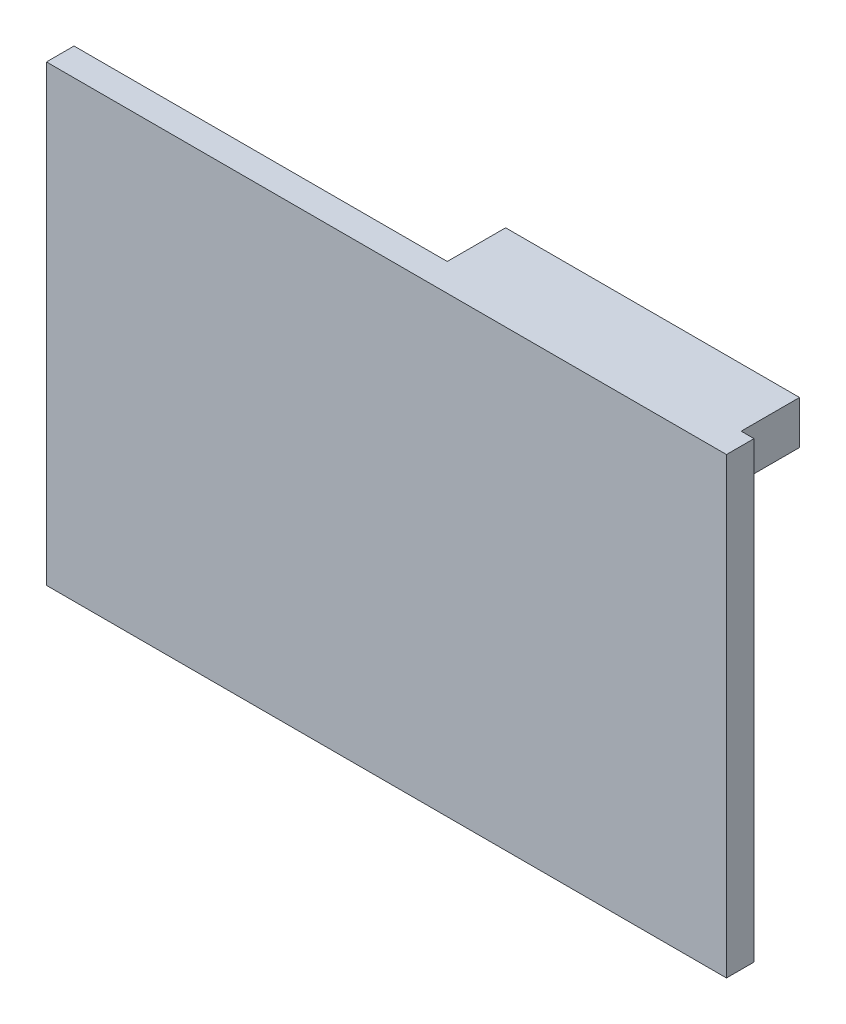
ISO-10303-21;
HEADER;
FILE_DESCRIPTION(('STEP AP214'),'2;1');
FILE_NAME('part.step','',(''),(''),'','','');
FILE_SCHEMA(('AUTOMOTIVE_DESIGN { 1 0 10303 214 1 1 1 1 }'));
ENDSEC;
DATA;
#1=APPLICATION_CONTEXT('core data for automotive mechanical design processes');
#2=APPLICATION_PROTOCOL_DEFINITION('international standard','automotive_design',2000,#1);
#3=PRODUCT_CONTEXT('',#1,'mechanical');
#4=PRODUCT('Part','Part','',(#3));
#5=PRODUCT_RELATED_PRODUCT_CATEGORY('part','',(#4));
#6=PRODUCT_DEFINITION_FORMATION('','',#4);
#7=PRODUCT_DEFINITION_CONTEXT('part definition',#1,'design');
#8=PRODUCT_DEFINITION('design','',#6,#7);
#9=PRODUCT_DEFINITION_SHAPE('','',#8);
#10=(LENGTH_UNIT() NAMED_UNIT(*) SI_UNIT(.MILLI.,.METRE.));
#11=(NAMED_UNIT(*) PLANE_ANGLE_UNIT() SI_UNIT($,.RADIAN.));
#12=(NAMED_UNIT(*) SI_UNIT($,.STERADIAN.) SOLID_ANGLE_UNIT());
#13=UNCERTAINTY_MEASURE_WITH_UNIT(LENGTH_MEASURE(1.E-05),#10,'distance_accuracy_value','');
#14=(GEOMETRIC_REPRESENTATION_CONTEXT(3) GLOBAL_UNCERTAINTY_ASSIGNED_CONTEXT((#13)) GLOBAL_UNIT_ASSIGNED_CONTEXT((#10,
#11,#12)) REPRESENTATION_CONTEXT('',''));
#15=CARTESIAN_POINT('',(0.,0.,0.));
#16=DIRECTION('',(0.,0.,1.));
#17=DIRECTION('',(1.,0.,0.));
#18=AXIS2_PLACEMENT_3D('',#15,#16,#17);
#19=CARTESIAN_POINT('',(36.9846355833028,24.656423722233,3.000000096));
#20=DIRECTION('',(-1.,0.,0.));
#21=DIRECTION('',(0.,0.,1.));
#22=AXIS2_PLACEMENT_3D('',#19,#20,#21);
#23=PLANE('',#22);
#24=DIRECTION('',(0.,1.,0.));
#25=VECTOR('',#24,1.);
#26=CARTESIAN_POINT('',(36.9846355833028,24.656423722233,0.));
#27=LINE('',#26,#25);
#28=CARTESIAN_POINT('',(36.9846355833028,-24.656423722233,0.));
#29=VERTEX_POINT('',#28);
#30=CARTESIAN_POINT('',(36.9846355833028,24.656423722233,0.));
#31=VERTEX_POINT('',#30);
#32=EDGE_CURVE('E161',#29,#31,#27,.T.);
#33=ORIENTED_EDGE('',*,*,#32,.T.);
#34=DIRECTION('',(0.,0.,-1.));
#35=VECTOR('',#34,1.);
#36=CARTESIAN_POINT('',(36.9846355833028,24.656423722233,3.000000096));
#37=LINE('',#36,#35);
#38=CARTESIAN_POINT('',(36.9846355833028,24.656423722233,3.000000096));
#39=VERTEX_POINT('',#38);
#40=EDGE_CURVE('E11',#39,#31,#37,.T.);
#41=ORIENTED_EDGE('',*,*,#40,.F.);
#42=DIRECTION('',(0.,1.,0.));
#43=VECTOR('',#42,1.);
#44=CARTESIAN_POINT('',(36.9846355833028,24.656423722233,3.000000096));
#45=LINE('',#44,#43);
#46=CARTESIAN_POINT('',(36.9846355833028,-24.656423722233,3.000000096));
#47=VERTEX_POINT('',#46);
#48=EDGE_CURVE('E166',#47,#39,#45,.T.);
#49=ORIENTED_EDGE('',*,*,#48,.F.);
#50=DIRECTION('',(0.,0.,-1.));
#51=VECTOR('',#50,1.);
#52=CARTESIAN_POINT('',(36.9846355833028,-24.656423722233,3.000000096));
#53=LINE('',#52,#51);
#54=EDGE_CURVE('E176',#47,#29,#53,.T.);
#55=ORIENTED_EDGE('',*,*,#54,.T.);
#56=EDGE_LOOP('',(#33,#41,#49,#55));
#57=FACE_BOUND('',#56,.T.);
#58=ADVANCED_FACE('F43',(#57),#23,.F.);
#59=CARTESIAN_POINT('',(-36.9846355833028,24.656423722233,3.000000096));
#60=DIRECTION('',(0.,-1.,0.));
#61=DIRECTION('',(0.,0.,-1.));
#62=AXIS2_PLACEMENT_3D('',#59,#60,#61);
#63=PLANE('',#62);
#64=DIRECTION('',(-1.,0.,0.));
#65=VECTOR('',#64,1.);
#66=CARTESIAN_POINT('',(-36.9846355833028,24.656423722233,0.));
#67=LINE('',#66,#65);
#68=CARTESIAN_POINT('',(35.5844459173092,24.656423722233,0.));
#69=VERTEX_POINT('',#68);
#70=EDGE_CURVE('E181',#31,#69,#67,.T.);
#71=ORIENTED_EDGE('',*,*,#70,.T.);
#72=DIRECTION('',(0.,0.,1.));
#73=VECTOR('',#72,1.);
#74=CARTESIAN_POINT('',(35.5844459173092,24.656423722233,-6.35));
#75=LINE('',#74,#73);
#76=CARTESIAN_POINT('',(35.5844459173092,24.656423722233,-6.35));
#77=VERTEX_POINT('',#76);
#78=EDGE_CURVE('E58',#77,#69,#75,.T.);
#79=ORIENTED_EDGE('',*,*,#78,.F.);
#80=DIRECTION('',(-1.,0.,0.));
#81=VECTOR('',#80,1.);
#82=CARTESIAN_POINT('',(3.61264772844525,24.656423722233,-6.35));
#83=LINE('',#82,#81);
#84=CARTESIAN_POINT('',(3.61264772844525,24.656423722233,-6.35));
#85=VERTEX_POINT('',#84);
#86=EDGE_CURVE('E130',#77,#85,#83,.T.);
#87=ORIENTED_EDGE('',*,*,#86,.T.);
#88=DIRECTION('',(0.,0.,1.));
#89=VECTOR('',#88,1.);
#90=CARTESIAN_POINT('',(3.61264772844525,24.656423722233,-6.35));
#91=LINE('',#90,#89);
#92=CARTESIAN_POINT('',(3.61264772844525,24.656423722233,0.));
#93=VERTEX_POINT('',#92);
#94=EDGE_CURVE('E143',#85,#93,#91,.T.);
#95=ORIENTED_EDGE('',*,*,#94,.T.);
#96=CARTESIAN_POINT('',(-36.9846355833028,24.656423722233,0.));
#97=VERTEX_POINT('',#96);
#98=EDGE_CURVE('E180',#93,#97,#67,.T.);
#99=ORIENTED_EDGE('',*,*,#98,.T.);
#100=DIRECTION('',(0.,0.,-1.));
#101=VECTOR('',#100,1.);
#102=CARTESIAN_POINT('',(-36.9846355833028,24.656423722233,3.000000096));
#103=LINE('',#102,#101);
#104=CARTESIAN_POINT('',(-36.9846355833028,24.656423722233,3.000000096));
#105=VERTEX_POINT('',#104);
#106=EDGE_CURVE('E51',#105,#97,#103,.T.);
#107=ORIENTED_EDGE('',*,*,#106,.F.);
#108=DIRECTION('',(-1.,0.,0.));
#109=VECTOR('',#108,1.);
#110=CARTESIAN_POINT('',(-36.9846355833028,24.656423722233,3.000000096));
#111=LINE('',#110,#109);
#112=EDGE_CURVE('E95',#39,#105,#111,.T.);
#113=ORIENTED_EDGE('',*,*,#112,.F.);
#114=ORIENTED_EDGE('',*,*,#40,.T.);
#115=EDGE_LOOP('',(#71,#79,#87,#95,#99,#107,#113,#114));
#116=FACE_BOUND('',#115,.T.);
#117=ADVANCED_FACE('F217',(#116),#63,.F.);
#118=CARTESIAN_POINT('',(-36.9846355833028,24.656423722233,3.000000096));
#119=DIRECTION('',(1.,0.,0.));
#120=DIRECTION('',(0.,1.,0.));
#121=AXIS2_PLACEMENT_3D('',#118,#119,#120);
#122=PLANE('',#121);
#123=DIRECTION('',(0.,-1.,0.));
#124=VECTOR('',#123,1.);
#125=CARTESIAN_POINT('',(-36.9846355833028,24.656423722233,0.));
#126=LINE('',#125,#124);
#127=CARTESIAN_POINT('',(-36.9846355833027,-24.656423722233,0.));
#128=VERTEX_POINT('',#127);
#129=EDGE_CURVE('E185',#97,#128,#126,.T.);
#130=ORIENTED_EDGE('',*,*,#129,.T.);
#131=DIRECTION('',(0.,0.,-1.));
#132=VECTOR('',#131,1.);
#133=CARTESIAN_POINT('',(-36.9846355833027,-24.656423722233,3.000000096));
#134=LINE('',#133,#132);
#135=CARTESIAN_POINT('',(-36.9846355833027,-24.656423722233,3.000000096));
#136=VERTEX_POINT('',#135);
#137=EDGE_CURVE('E192',#136,#128,#134,.T.);
#138=ORIENTED_EDGE('',*,*,#137,.F.);
#139=DIRECTION('',(0.,-1.,0.));
#140=VECTOR('',#139,1.);
#141=CARTESIAN_POINT('',(-36.9846355833028,24.656423722233,3.000000096));
#142=LINE('',#141,#140);
#143=EDGE_CURVE('E171',#105,#136,#142,.T.);
#144=ORIENTED_EDGE('',*,*,#143,.F.);
#145=ORIENTED_EDGE('',*,*,#106,.T.);
#146=EDGE_LOOP('',(#130,#138,#144,#145));
#147=FACE_BOUND('',#146,.T.);
#148=ADVANCED_FACE('F199',(#147),#122,.F.);
#149=CARTESIAN_POINT('',(-36.9846355833027,-24.656423722233,3.000000096));
#150=DIRECTION('',(0.,1.,0.));
#151=DIRECTION('',(0.,0.,1.));
#152=AXIS2_PLACEMENT_3D('',#149,#150,#151);
#153=PLANE('',#152);
#154=DIRECTION('',(1.,0.,0.));
#155=VECTOR('',#154,1.);
#156=CARTESIAN_POINT('',(-36.9846355833027,-24.656423722233,0.));
#157=LINE('',#156,#155);
#158=EDGE_CURVE('E88',#128,#29,#157,.T.);
#159=ORIENTED_EDGE('',*,*,#158,.T.);
#160=ORIENTED_EDGE('',*,*,#54,.F.);
#161=DIRECTION('',(1.,0.,0.));
#162=VECTOR('',#161,1.);
#163=CARTESIAN_POINT('',(-36.9846355833027,-24.656423722233,3.000000096));
#164=LINE('',#163,#162);
#165=EDGE_CURVE('E67',#136,#47,#164,.T.);
#166=ORIENTED_EDGE('',*,*,#165,.F.);
#167=ORIENTED_EDGE('',*,*,#137,.T.);
#168=EDGE_LOOP('',(#159,#160,#166,#167));
#169=FACE_BOUND('',#168,.T.);
#170=ADVANCED_FACE('F208',(#169),#153,.F.);
#171=CARTESIAN_POINT('',(0.,0.,3.000000096));
#172=DIRECTION('',(0.,0.,1.));
#173=DIRECTION('',(1.,0.,0.));
#174=AXIS2_PLACEMENT_3D('',#171,#172,#173);
#175=PLANE('',#174);
#176=ORIENTED_EDGE('',*,*,#48,.T.);
#177=ORIENTED_EDGE('',*,*,#112,.T.);
#178=ORIENTED_EDGE('',*,*,#143,.T.);
#179=ORIENTED_EDGE('',*,*,#165,.T.);
#180=EDGE_LOOP('',(#176,#177,#178,#179));
#181=FACE_BOUND('',#180,.T.);
#182=ADVANCED_FACE('F210',(#181),#175,.T.);
#183=CARTESIAN_POINT('',(0.,0.,0.));
#184=DIRECTION('',(0.,0.,1.));
#185=DIRECTION('',(1.,0.,0.));
#186=AXIS2_PLACEMENT_3D('',#183,#184,#185);
#187=PLANE('',#186);
#188=ORIENTED_EDGE('',*,*,#98,.F.);
#189=DIRECTION('',(0.,-1.,0.));
#190=VECTOR('',#189,1.);
#191=CARTESIAN_POINT('',(3.61264772844525,24.656423722233,0.));
#192=LINE('',#191,#190);
#193=CARTESIAN_POINT('',(3.61264772844525,19.941158521718,0.));
#194=VERTEX_POINT('',#193);
#195=EDGE_CURVE('E154',#93,#194,#192,.T.);
#196=ORIENTED_EDGE('',*,*,#195,.T.);
#197=DIRECTION('',(1.,0.,0.));
#198=VECTOR('',#197,1.);
#199=CARTESIAN_POINT('',(3.61264772844525,19.941158521718,0.));
#200=LINE('',#199,#198);
#201=CARTESIAN_POINT('',(35.5844459173092,19.941158521718,0.));
#202=VERTEX_POINT('',#201);
#203=EDGE_CURVE('E123',#194,#202,#200,.T.);
#204=ORIENTED_EDGE('',*,*,#203,.T.);
#205=DIRECTION('',(0.,1.,0.));
#206=VECTOR('',#205,1.);
#207=CARTESIAN_POINT('',(35.5844459173092,24.656423722233,0.));
#208=LINE('',#207,#206);
#209=EDGE_CURVE('E145',#202,#69,#208,.T.);
#210=ORIENTED_EDGE('',*,*,#209,.T.);
#211=ORIENTED_EDGE('',*,*,#70,.F.);
#212=ORIENTED_EDGE('',*,*,#32,.F.);
#213=ORIENTED_EDGE('',*,*,#158,.F.);
#214=ORIENTED_EDGE('',*,*,#129,.F.);
#215=EDGE_LOOP('',(#188,#196,#204,#210,#211,#212,#213,#214));
#216=FACE_BOUND('',#215,.T.);
#217=ADVANCED_FACE('F203',(#216),#187,.F.);
#218=CARTESIAN_POINT('',(3.61264772844525,24.656423722233,-6.35));
#219=DIRECTION('',(-1.,0.,0.));
#220=DIRECTION('',(0.,-1.,0.));
#221=AXIS2_PLACEMENT_3D('',#218,#219,#220);
#222=PLANE('',#221);
#223=ORIENTED_EDGE('',*,*,#195,.F.);
#224=ORIENTED_EDGE('',*,*,#94,.F.);
#225=DIRECTION('',(0.,-1.,0.));
#226=VECTOR('',#225,1.);
#227=CARTESIAN_POINT('',(3.61264772844525,24.656423722233,-6.35));
#228=LINE('',#227,#226);
#229=CARTESIAN_POINT('',(3.61264772844525,19.941158521718,-6.35));
#230=VERTEX_POINT('',#229);
#231=EDGE_CURVE('E137',#85,#230,#228,.T.);
#232=ORIENTED_EDGE('',*,*,#231,.T.);
#233=DIRECTION('',(0.,0.,1.));
#234=VECTOR('',#233,1.);
#235=CARTESIAN_POINT('',(3.61264772844525,19.941158521718,-6.35));
#236=LINE('',#235,#234);
#237=EDGE_CURVE('E118',#230,#194,#236,.T.);
#238=ORIENTED_EDGE('',*,*,#237,.T.);
#239=EDGE_LOOP('',(#223,#224,#232,#238));
#240=FACE_BOUND('',#239,.T.);
#241=ADVANCED_FACE('F142',(#240),#222,.T.);
#242=CARTESIAN_POINT('',(35.5844459173092,24.656423722233,-6.35));
#243=DIRECTION('',(1.,0.,0.));
#244=DIRECTION('',(0.,0.,-1.));
#245=AXIS2_PLACEMENT_3D('',#242,#243,#244);
#246=PLANE('',#245);
#247=ORIENTED_EDGE('',*,*,#209,.F.);
#248=DIRECTION('',(0.,0.,1.));
#249=VECTOR('',#248,1.);
#250=CARTESIAN_POINT('',(35.5844459173092,19.941158521718,-6.35));
#251=LINE('',#250,#249);
#252=CARTESIAN_POINT('',(35.5844459173092,19.941158521718,-6.35));
#253=VERTEX_POINT('',#252);
#254=EDGE_CURVE('E129',#253,#202,#251,.T.);
#255=ORIENTED_EDGE('',*,*,#254,.F.);
#256=DIRECTION('',(0.,1.,0.));
#257=VECTOR('',#256,1.);
#258=CARTESIAN_POINT('',(35.5844459173092,24.656423722233,-6.35));
#259=LINE('',#258,#257);
#260=EDGE_CURVE('E139',#253,#77,#259,.T.);
#261=ORIENTED_EDGE('',*,*,#260,.T.);
#262=ORIENTED_EDGE('',*,*,#78,.T.);
#263=EDGE_LOOP('',(#247,#255,#261,#262));
#264=FACE_BOUND('',#263,.T.);
#265=ADVANCED_FACE('F226',(#264),#246,.T.);
#266=CARTESIAN_POINT('',(3.61264772844525,19.941158521718,-6.35));
#267=DIRECTION('',(0.,-1.,0.));
#268=DIRECTION('',(0.,0.,-1.));
#269=AXIS2_PLACEMENT_3D('',#266,#267,#268);
#270=PLANE('',#269);
#271=ORIENTED_EDGE('',*,*,#203,.F.);
#272=ORIENTED_EDGE('',*,*,#237,.F.);
#273=DIRECTION('',(1.,0.,0.));
#274=VECTOR('',#273,1.);
#275=CARTESIAN_POINT('',(3.61264772844525,19.941158521718,-6.35));
#276=LINE('',#275,#274);
#277=EDGE_CURVE('E121',#230,#253,#276,.T.);
#278=ORIENTED_EDGE('',*,*,#277,.T.);
#279=ORIENTED_EDGE('',*,*,#254,.T.);
#280=EDGE_LOOP('',(#271,#272,#278,#279));
#281=FACE_BOUND('',#280,.T.);
#282=ADVANCED_FACE('F120',(#281),#270,.T.);
#283=CARTESIAN_POINT('',(0.,0.,-6.35));
#284=DIRECTION('',(0.,0.,1.));
#285=DIRECTION('',(1.,0.,0.));
#286=AXIS2_PLACEMENT_3D('',#283,#284,#285);
#287=PLANE('',#286);
#288=ORIENTED_EDGE('',*,*,#231,.F.);
#289=ORIENTED_EDGE('',*,*,#86,.F.);
#290=ORIENTED_EDGE('',*,*,#260,.F.);
#291=ORIENTED_EDGE('',*,*,#277,.F.);
#292=EDGE_LOOP('',(#288,#289,#290,#291));
#293=FACE_BOUND('',#292,.T.);
#294=ADVANCED_FACE('F135',(#293),#287,.F.);
#295=CLOSED_SHELL('',(#58,#117,#148,#170,#182,#217,#241,#265,#282,#294));
#296=MANIFOLD_SOLID_BREP('B2',#295);
#297=ADVANCED_BREP_SHAPE_REPRESENTATION('',(#18,#296),#14);
#298=SHAPE_DEFINITION_REPRESENTATION(#9,#297);
ENDSEC;
END-ISO-10303-21;
